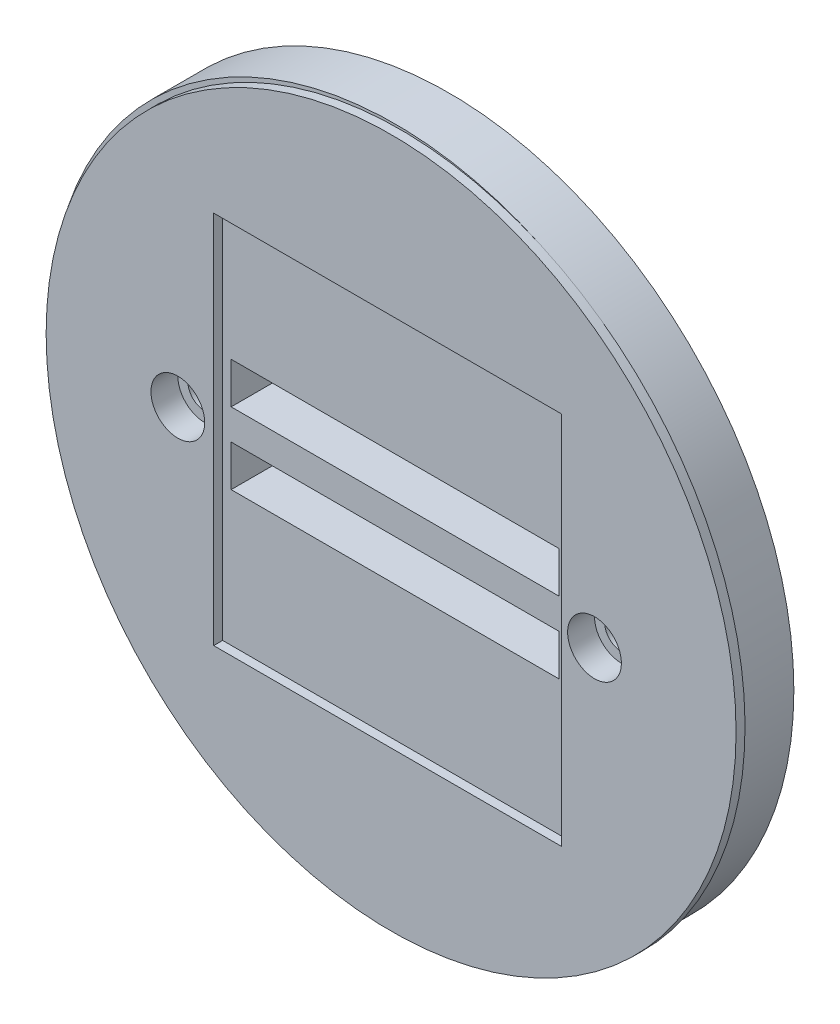
ISO-10303-21;
HEADER;
FILE_DESCRIPTION(('STEP AP214'),'2;1');
FILE_NAME('part.step','',(''),(''),'','','');
FILE_SCHEMA(('AUTOMOTIVE_DESIGN { 1 0 10303 214 1 1 1 1 }'));
ENDSEC;
DATA;
#1=APPLICATION_CONTEXT('core data for automotive mechanical design processes');
#2=APPLICATION_PROTOCOL_DEFINITION('international standard','automotive_design',2000,#1);
#3=PRODUCT_CONTEXT('',#1,'mechanical');
#4=PRODUCT('Part','Part','',(#3));
#5=PRODUCT_RELATED_PRODUCT_CATEGORY('part','',(#4));
#6=PRODUCT_DEFINITION_FORMATION('','',#4);
#7=PRODUCT_DEFINITION_CONTEXT('part definition',#1,'design');
#8=PRODUCT_DEFINITION('design','',#6,#7);
#9=PRODUCT_DEFINITION_SHAPE('','',#8);
#10=(LENGTH_UNIT() NAMED_UNIT(*) SI_UNIT(.MILLI.,.METRE.));
#11=(NAMED_UNIT(*) PLANE_ANGLE_UNIT() SI_UNIT($,.RADIAN.));
#12=(NAMED_UNIT(*) SI_UNIT($,.STERADIAN.) SOLID_ANGLE_UNIT());
#13=UNCERTAINTY_MEASURE_WITH_UNIT(LENGTH_MEASURE(1.E-05),#10,'distance_accuracy_value','');
#14=(GEOMETRIC_REPRESENTATION_CONTEXT(3) GLOBAL_UNCERTAINTY_ASSIGNED_CONTEXT((#13)) GLOBAL_UNIT_ASSIGNED_CONTEXT((#10,
#11,#12)) REPRESENTATION_CONTEXT('',''));
#15=CARTESIAN_POINT('',(0.,0.,0.));
#16=DIRECTION('',(0.,0.,1.));
#17=DIRECTION('',(1.,0.,0.));
#18=AXIS2_PLACEMENT_3D('',#15,#16,#17);
#19=CARTESIAN_POINT('',(23.25,0.,-6.));
#20=DIRECTION('',(0.,0.,1.));
#21=DIRECTION('',(1.,0.,0.));
#22=AXIS2_PLACEMENT_3D('',#19,#20,#21);
#23=CYLINDRICAL_SURFACE('',#22,1.875);
#24=CARTESIAN_POINT('',(23.25,0.,-6.));
#25=DIRECTION('',(0.,0.,1.));
#26=DIRECTION('',(-1.,0.,0.));
#27=AXIS2_PLACEMENT_3D('',#24,#25,#26);
#28=CIRCLE('',#27,1.875);
#29=CARTESIAN_POINT('',(21.375,0.,-6.));
#30=VERTEX_POINT('',#29);
#31=EDGE_CURVE('E176',#30,#30,#28,.T.);
#32=ORIENTED_EDGE('',*,*,#31,.F.);
#33=EDGE_LOOP('',(#32));
#34=FACE_BOUND('',#33,.T.);
#35=CARTESIAN_POINT('',(23.25,0.,-2.));
#36=DIRECTION('',(0.,0.,1.));
#37=DIRECTION('',(1.,0.,0.));
#38=AXIS2_PLACEMENT_3D('',#35,#36,#37);
#39=CIRCLE('',#38,1.875);
#40=CARTESIAN_POINT('',(25.125,0.,-2.));
#41=VERTEX_POINT('',#40);
#42=EDGE_CURVE('E37',#41,#41,#39,.F.);
#43=ORIENTED_EDGE('',*,*,#42,.F.);
#44=EDGE_LOOP('',(#43));
#45=FACE_BOUND('',#44,.T.);
#46=ADVANCED_FACE('F33',(#34,#45),#23,.F.);
#47=CARTESIAN_POINT('',(-23.25,0.,-6.));
#48=DIRECTION('',(0.,0.,1.));
#49=DIRECTION('',(1.,0.,0.));
#50=AXIS2_PLACEMENT_3D('',#47,#48,#49);
#51=CYLINDRICAL_SURFACE('',#50,1.875);
#52=CARTESIAN_POINT('',(-23.25,0.,-6.));
#53=DIRECTION('',(0.,0.,1.));
#54=DIRECTION('',(1.,0.,0.));
#55=AXIS2_PLACEMENT_3D('',#52,#53,#54);
#56=CIRCLE('',#55,1.875);
#57=CARTESIAN_POINT('',(-21.375,0.,-6.));
#58=VERTEX_POINT('',#57);
#59=EDGE_CURVE('E206',#58,#58,#56,.T.);
#60=ORIENTED_EDGE('',*,*,#59,.F.);
#61=EDGE_LOOP('',(#60));
#62=FACE_BOUND('',#61,.T.);
#63=CARTESIAN_POINT('',(-23.25,0.,-2.));
#64=DIRECTION('',(0.,0.,1.));
#65=DIRECTION('',(1.,0.,0.));
#66=AXIS2_PLACEMENT_3D('',#63,#64,#65);
#67=CIRCLE('',#66,1.875);
#68=CARTESIAN_POINT('',(-21.375,0.,-2.));
#69=VERTEX_POINT('',#68);
#70=EDGE_CURVE('E162',#69,#69,#67,.F.);
#71=ORIENTED_EDGE('',*,*,#70,.F.);
#72=EDGE_LOOP('',(#71));
#73=FACE_BOUND('',#72,.T.);
#74=ADVANCED_FACE('F272',(#62,#73),#51,.F.);
#75=CARTESIAN_POINT('',(0.,0.,0.));
#76=DIRECTION('',(0.,0.,1.));
#77=DIRECTION('',(1.,0.,0.));
#78=AXIS2_PLACEMENT_3D('',#75,#76,#77);
#79=PLANE('',#78);
#80=DIRECTION('',(-1.,0.,0.));
#81=VECTOR('',#80,1.);
#82=CARTESIAN_POINT('',(-18.3,6.59999999999948,0.));
#83=LINE('',#82,#81);
#84=CARTESIAN_POINT('',(18.3,6.59999999999948,0.));
#85=VERTEX_POINT('',#84);
#86=CARTESIAN_POINT('',(-18.3,6.59999999999948,0.));
#87=VERTEX_POINT('',#86);
#88=EDGE_CURVE('E215',#85,#87,#83,.T.);
#89=ORIENTED_EDGE('',*,*,#88,.F.);
#90=DIRECTION('',(0.,1.,0.));
#91=VECTOR('',#90,1.);
#92=CARTESIAN_POINT('',(18.3,6.59999999999948,0.));
#93=LINE('',#92,#91);
#94=CARTESIAN_POINT('',(18.3,1.99999999999948,0.));
#95=VERTEX_POINT('',#94);
#96=EDGE_CURVE('E220',#95,#85,#93,.T.);
#97=ORIENTED_EDGE('',*,*,#96,.F.);
#98=DIRECTION('',(1.,0.,0.));
#99=VECTOR('',#98,1.);
#100=CARTESIAN_POINT('',(18.3,1.99999999999948,0.));
#101=LINE('',#100,#99);
#102=CARTESIAN_POINT('',(-18.3,1.99999999999948,0.));
#103=VERTEX_POINT('',#102);
#104=EDGE_CURVE('E234',#103,#95,#101,.T.);
#105=ORIENTED_EDGE('',*,*,#104,.F.);
#106=DIRECTION('',(0.,-1.,0.));
#107=VECTOR('',#106,1.);
#108=CARTESIAN_POINT('',(-18.3,1.99999999999948,0.));
#109=LINE('',#108,#107);
#110=EDGE_CURVE('E231',#87,#103,#109,.T.);
#111=ORIENTED_EDGE('',*,*,#110,.F.);
#112=EDGE_LOOP('',(#89,#97,#105,#111));
#113=FACE_BOUND('',#112,.T.);
#114=DIRECTION('',(0.,1.,0.));
#115=VECTOR('',#114,1.);
#116=CARTESIAN_POINT('',(18.3,-6.00000000000038,0.));
#117=LINE('',#116,#115);
#118=CARTESIAN_POINT('',(18.3,-6.00000000000038,0.));
#119=VERTEX_POINT('',#118);
#120=CARTESIAN_POINT('',(18.3,-1.40000000000038,0.));
#121=VERTEX_POINT('',#120);
#122=EDGE_CURVE('E180',#119,#121,#117,.T.);
#123=ORIENTED_EDGE('',*,*,#122,.F.);
#124=DIRECTION('',(1.,0.,0.));
#125=VECTOR('',#124,1.);
#126=CARTESIAN_POINT('',(-18.3,-6.00000000000038,0.));
#127=LINE('',#126,#125);
#128=CARTESIAN_POINT('',(-18.3,-6.00000000000038,0.));
#129=VERTEX_POINT('',#128);
#130=EDGE_CURVE('E185',#129,#119,#127,.T.);
#131=ORIENTED_EDGE('',*,*,#130,.F.);
#132=DIRECTION('',(0.,-1.,0.));
#133=VECTOR('',#132,1.);
#134=CARTESIAN_POINT('',(-18.3,-1.40000000000038,0.));
#135=LINE('',#134,#133);
#136=CARTESIAN_POINT('',(-18.3,-1.40000000000038,0.));
#137=VERTEX_POINT('',#136);
#138=EDGE_CURVE('E199',#137,#129,#135,.T.);
#139=ORIENTED_EDGE('',*,*,#138,.F.);
#140=DIRECTION('',(-1.,0.,0.));
#141=VECTOR('',#140,1.);
#142=CARTESIAN_POINT('',(18.3,-1.40000000000038,0.));
#143=LINE('',#142,#141);
#144=EDGE_CURVE('E196',#121,#137,#143,.T.);
#145=ORIENTED_EDGE('',*,*,#144,.F.);
#146=EDGE_LOOP('',(#123,#131,#139,#145));
#147=FACE_BOUND('',#146,.T.);
#148=DIRECTION('',(1.,0.,0.));
#149=VECTOR('',#148,1.);
#150=CARTESIAN_POINT('',(-19.25,-21.05,0.));
#151=LINE('',#150,#149);
#152=CARTESIAN_POINT('',(-19.25,-21.05,0.));
#153=VERTEX_POINT('',#152);
#154=CARTESIAN_POINT('',(19.55,-21.05,0.));
#155=VERTEX_POINT('',#154);
#156=EDGE_CURVE('E140',#153,#155,#151,.T.);
#157=ORIENTED_EDGE('',*,*,#156,.T.);
#158=DIRECTION('',(0.,1.,0.));
#159=VECTOR('',#158,1.);
#160=CARTESIAN_POINT('',(19.55,20.75,0.));
#161=LINE('',#160,#159);
#162=CARTESIAN_POINT('',(19.55,20.75,0.));
#163=VERTEX_POINT('',#162);
#164=EDGE_CURVE('E160',#155,#163,#161,.T.);
#165=ORIENTED_EDGE('',*,*,#164,.T.);
#166=DIRECTION('',(-1.,0.,0.));
#167=VECTOR('',#166,1.);
#168=CARTESIAN_POINT('',(-19.25,20.75,0.));
#169=LINE('',#168,#167);
#170=CARTESIAN_POINT('',(-19.25,20.75,0.));
#171=VERTEX_POINT('',#170);
#172=EDGE_CURVE('E146',#163,#171,#169,.T.);
#173=ORIENTED_EDGE('',*,*,#172,.T.);
#174=DIRECTION('',(0.,-1.,0.));
#175=VECTOR('',#174,1.);
#176=CARTESIAN_POINT('',(-19.25,20.75,0.));
#177=LINE('',#176,#175);
#178=EDGE_CURVE('E164',#171,#153,#177,.T.);
#179=ORIENTED_EDGE('',*,*,#178,.T.);
#180=EDGE_LOOP('',(#157,#165,#173,#179));
#181=FACE_BOUND('',#180,.T.);
#182=ADVANCED_FACE('F278',(#113,#147,#181),#79,.T.);
#183=CARTESIAN_POINT('',(0.,0.,-6.));
#184=DIRECTION('',(0.,0.,1.));
#185=DIRECTION('',(1.,0.,0.));
#186=AXIS2_PLACEMENT_3D('',#183,#184,#185);
#187=CYLINDRICAL_SURFACE('',#186,38.5);
#188=CARTESIAN_POINT('',(0.,0.,-6.));
#189=DIRECTION('',(0.,0.,1.));
#190=DIRECTION('',(1.,0.,0.));
#191=AXIS2_PLACEMENT_3D('',#188,#189,#190);
#192=CIRCLE('',#191,38.5);
#193=CARTESIAN_POINT('',(38.5,0.,-6.));
#194=VERTEX_POINT('',#193);
#195=EDGE_CURVE('E11',#194,#194,#192,.T.);
#196=ORIENTED_EDGE('',*,*,#195,.T.);
#197=EDGE_LOOP('',(#196));
#198=FACE_BOUND('',#197,.T.);
#199=CARTESIAN_POINT('',(0.,0.,0.));
#200=DIRECTION('',(0.,0.,1.));
#201=DIRECTION('',(1.,0.,0.));
#202=AXIS2_PLACEMENT_3D('',#199,#200,#201);
#203=CIRCLE('',#202,38.5);
#204=CARTESIAN_POINT('',(16.2059229646879,34.9230305223158,0.));
#205=VERTEX_POINT('',#204);
#206=CARTESIAN_POINT('',(-15.6559229646895,-35.173030522315,0.));
#207=VERTEX_POINT('',#206);
#208=EDGE_CURVE('E42',#205,#207,#203,.T.);
#209=ORIENTED_EDGE('',*,*,#208,.F.);
#210=EDGE_CURVE('E241',#207,#205,#203,.T.);
#211=ORIENTED_EDGE('',*,*,#210,.F.);
#212=EDGE_LOOP('',(#209,#211));
#213=FACE_BOUND('',#212,.T.);
#214=ADVANCED_FACE('F35',(#198,#213),#187,.T.);
#215=CARTESIAN_POINT('',(0.,0.,-6.));
#216=DIRECTION('',(0.,0.,1.));
#217=DIRECTION('',(1.,0.,0.));
#218=AXIS2_PLACEMENT_3D('',#215,#216,#217);
#219=PLANE('',#218);
#220=ORIENTED_EDGE('',*,*,#31,.T.);
#221=EDGE_LOOP('',(#220));
#222=FACE_BOUND('',#221,.T.);
#223=DIRECTION('',(1.,0.,0.));
#224=VECTOR('',#223,1.);
#225=CARTESIAN_POINT('',(-18.3,-6.00000000000038,-6.));
#226=LINE('',#225,#224);
#227=CARTESIAN_POINT('',(-18.3,-6.00000000000038,-6.));
#228=VERTEX_POINT('',#227);
#229=CARTESIAN_POINT('',(18.3,-6.00000000000038,-6.));
#230=VERTEX_POINT('',#229);
#231=EDGE_CURVE('E191',#228,#230,#226,.T.);
#232=ORIENTED_EDGE('',*,*,#231,.T.);
#233=DIRECTION('',(0.,1.,0.));
#234=VECTOR('',#233,1.);
#235=CARTESIAN_POINT('',(18.3,-6.00000000000038,-6.));
#236=LINE('',#235,#234);
#237=CARTESIAN_POINT('',(18.3,-1.40000000000038,-6.));
#238=VERTEX_POINT('',#237);
#239=EDGE_CURVE('E181',#230,#238,#236,.T.);
#240=ORIENTED_EDGE('',*,*,#239,.T.);
#241=DIRECTION('',(-1.,0.,0.));
#242=VECTOR('',#241,1.);
#243=CARTESIAN_POINT('',(18.3,-1.40000000000038,-6.));
#244=LINE('',#243,#242);
#245=CARTESIAN_POINT('',(-18.3,-1.40000000000038,-6.));
#246=VERTEX_POINT('',#245);
#247=EDGE_CURVE('E184',#238,#246,#244,.T.);
#248=ORIENTED_EDGE('',*,*,#247,.T.);
#249=DIRECTION('',(0.,-1.,0.));
#250=VECTOR('',#249,1.);
#251=CARTESIAN_POINT('',(-18.3,-1.40000000000038,-6.));
#252=LINE('',#251,#250);
#253=EDGE_CURVE('E188',#246,#228,#252,.T.);
#254=ORIENTED_EDGE('',*,*,#253,.T.);
#255=EDGE_LOOP('',(#232,#240,#248,#254));
#256=FACE_BOUND('',#255,.T.);
#257=ORIENTED_EDGE('',*,*,#59,.T.);
#258=EDGE_LOOP('',(#257));
#259=FACE_BOUND('',#258,.T.);
#260=DIRECTION('',(0.,1.,0.));
#261=VECTOR('',#260,1.);
#262=CARTESIAN_POINT('',(18.3,6.59999999999948,-6.));
#263=LINE('',#262,#261);
#264=CARTESIAN_POINT('',(18.3,1.99999999999948,-6.));
#265=VERTEX_POINT('',#264);
#266=CARTESIAN_POINT('',(18.3,6.59999999999948,-6.));
#267=VERTEX_POINT('',#266);
#268=EDGE_CURVE('E226',#265,#267,#263,.T.);
#269=ORIENTED_EDGE('',*,*,#268,.T.);
#270=DIRECTION('',(-1.,0.,0.));
#271=VECTOR('',#270,1.);
#272=CARTESIAN_POINT('',(-18.3,6.59999999999948,-6.));
#273=LINE('',#272,#271);
#274=CARTESIAN_POINT('',(-18.3,6.59999999999948,-6.));
#275=VERTEX_POINT('',#274);
#276=EDGE_CURVE('E216',#267,#275,#273,.T.);
#277=ORIENTED_EDGE('',*,*,#276,.T.);
#278=DIRECTION('',(0.,-1.,0.));
#279=VECTOR('',#278,1.);
#280=CARTESIAN_POINT('',(-18.3,1.99999999999948,-6.));
#281=LINE('',#280,#279);
#282=CARTESIAN_POINT('',(-18.3,1.99999999999948,-6.));
#283=VERTEX_POINT('',#282);
#284=EDGE_CURVE('E219',#275,#283,#281,.T.);
#285=ORIENTED_EDGE('',*,*,#284,.T.);
#286=DIRECTION('',(1.,0.,0.));
#287=VECTOR('',#286,1.);
#288=CARTESIAN_POINT('',(18.3,1.99999999999948,-6.));
#289=LINE('',#288,#287);
#290=EDGE_CURVE('E223',#283,#265,#289,.T.);
#291=ORIENTED_EDGE('',*,*,#290,.T.);
#292=EDGE_LOOP('',(#269,#277,#285,#291));
#293=FACE_BOUND('',#292,.T.);
#294=ORIENTED_EDGE('',*,*,#195,.F.);
#295=EDGE_LOOP('',(#294));
#296=FACE_BOUND('',#295,.T.);
#297=ADVANCED_FACE('F320',(#222,#256,#259,#293,#296),#219,.F.);
#298=CARTESIAN_POINT('',(0.549999999999996,-0.249999999999997,0.));
#299=DIRECTION('',(0.,0.,1.));
#300=DIRECTION('',(1.,0.,0.));
#301=AXIS2_PLACEMENT_3D('',#298,#299,#300);
#302=CIRCLE('',#301,38.5);
#303=EDGE_CURVE('E57',#205,#207,#302,.T.);
#304=ORIENTED_EDGE('',*,*,#303,.F.);
#305=ORIENTED_EDGE('',*,*,#208,.T.);
#306=EDGE_LOOP('',(#304,#305));
#307=FACE_BOUND('',#306,.T.);
#308=ADVANCED_FACE('F318',(#307),#79,.T.);
#309=CARTESIAN_POINT('',(-18.3,6.59999999999948,-6.));
#310=DIRECTION('',(0.,1.,0.));
#311=DIRECTION('',(0.,0.,1.));
#312=AXIS2_PLACEMENT_3D('',#309,#310,#311);
#313=PLANE('',#312);
#314=ORIENTED_EDGE('',*,*,#88,.T.);
#315=DIRECTION('',(0.,0.,1.));
#316=VECTOR('',#315,1.);
#317=CARTESIAN_POINT('',(-18.3,6.59999999999948,-6.));
#318=LINE('',#317,#316);
#319=EDGE_CURVE('E229',#275,#87,#318,.T.);
#320=ORIENTED_EDGE('',*,*,#319,.F.);
#321=ORIENTED_EDGE('',*,*,#276,.F.);
#322=DIRECTION('',(0.,0.,1.));
#323=VECTOR('',#322,1.);
#324=CARTESIAN_POINT('',(18.3,6.59999999999948,-6.));
#325=LINE('',#324,#323);
#326=EDGE_CURVE('E239',#267,#85,#325,.T.);
#327=ORIENTED_EDGE('',*,*,#326,.T.);
#328=EDGE_LOOP('',(#314,#320,#321,#327));
#329=FACE_BOUND('',#328,.T.);
#330=ADVANCED_FACE('F308',(#329),#313,.F.);
#331=CARTESIAN_POINT('',(18.3,6.59999999999948,-6.));
#332=DIRECTION('',(1.,0.,0.));
#333=DIRECTION('',(0.,0.,-1.));
#334=AXIS2_PLACEMENT_3D('',#331,#332,#333);
#335=PLANE('',#334);
#336=ORIENTED_EDGE('',*,*,#96,.T.);
#337=ORIENTED_EDGE('',*,*,#326,.F.);
#338=ORIENTED_EDGE('',*,*,#268,.F.);
#339=DIRECTION('',(0.,0.,1.));
#340=VECTOR('',#339,1.);
#341=CARTESIAN_POINT('',(18.3,1.99999999999948,-6.));
#342=LINE('',#341,#340);
#343=EDGE_CURVE('E242',#265,#95,#342,.T.);
#344=ORIENTED_EDGE('',*,*,#343,.T.);
#345=EDGE_LOOP('',(#336,#337,#338,#344));
#346=FACE_BOUND('',#345,.T.);
#347=ADVANCED_FACE('F304',(#346),#335,.F.);
#348=CARTESIAN_POINT('',(18.3,1.99999999999948,-6.));
#349=DIRECTION('',(0.,-1.,0.));
#350=DIRECTION('',(1.,0.,0.));
#351=AXIS2_PLACEMENT_3D('',#348,#349,#350);
#352=PLANE('',#351);
#353=ORIENTED_EDGE('',*,*,#104,.T.);
#354=ORIENTED_EDGE('',*,*,#343,.F.);
#355=ORIENTED_EDGE('',*,*,#290,.F.);
#356=DIRECTION('',(0.,0.,1.));
#357=VECTOR('',#356,1.);
#358=CARTESIAN_POINT('',(-18.3,1.99999999999948,-6.));
#359=LINE('',#358,#357);
#360=EDGE_CURVE('E244',#283,#103,#359,.T.);
#361=ORIENTED_EDGE('',*,*,#360,.T.);
#362=EDGE_LOOP('',(#353,#354,#355,#361));
#363=FACE_BOUND('',#362,.T.);
#364=ADVANCED_FACE('F307',(#363),#352,.F.);
#365=CARTESIAN_POINT('',(-18.3,1.99999999999948,-6.));
#366=DIRECTION('',(-1.,0.,0.));
#367=DIRECTION('',(0.,0.,1.));
#368=AXIS2_PLACEMENT_3D('',#365,#366,#367);
#369=PLANE('',#368);
#370=ORIENTED_EDGE('',*,*,#110,.T.);
#371=ORIENTED_EDGE('',*,*,#360,.F.);
#372=ORIENTED_EDGE('',*,*,#284,.F.);
#373=ORIENTED_EDGE('',*,*,#319,.T.);
#374=EDGE_LOOP('',(#370,#371,#372,#373));
#375=FACE_BOUND('',#374,.T.);
#376=ADVANCED_FACE('F301',(#375),#369,.F.);
#377=CARTESIAN_POINT('',(18.3,-6.00000000000038,-6.));
#378=DIRECTION('',(1.,0.,0.));
#379=DIRECTION('',(0.,0.,-1.));
#380=AXIS2_PLACEMENT_3D('',#377,#378,#379);
#381=PLANE('',#380);
#382=ORIENTED_EDGE('',*,*,#122,.T.);
#383=DIRECTION('',(0.,0.,1.));
#384=VECTOR('',#383,1.);
#385=CARTESIAN_POINT('',(18.3,-1.40000000000038,-6.));
#386=LINE('',#385,#384);
#387=EDGE_CURVE('E194',#238,#121,#386,.T.);
#388=ORIENTED_EDGE('',*,*,#387,.F.);
#389=ORIENTED_EDGE('',*,*,#239,.F.);
#390=DIRECTION('',(0.,0.,1.));
#391=VECTOR('',#390,1.);
#392=CARTESIAN_POINT('',(18.3,-6.00000000000038,-6.));
#393=LINE('',#392,#391);
#394=EDGE_CURVE('E204',#230,#119,#393,.T.);
#395=ORIENTED_EDGE('',*,*,#394,.T.);
#396=EDGE_LOOP('',(#382,#388,#389,#395));
#397=FACE_BOUND('',#396,.T.);
#398=ADVANCED_FACE('F290',(#397),#381,.F.);
#399=CARTESIAN_POINT('',(-18.3,-6.00000000000038,-6.));
#400=DIRECTION('',(0.,-1.,0.));
#401=DIRECTION('',(0.,0.,-1.));
#402=AXIS2_PLACEMENT_3D('',#399,#400,#401);
#403=PLANE('',#402);
#404=ORIENTED_EDGE('',*,*,#130,.T.);
#405=ORIENTED_EDGE('',*,*,#394,.F.);
#406=ORIENTED_EDGE('',*,*,#231,.F.);
#407=DIRECTION('',(0.,0.,1.));
#408=VECTOR('',#407,1.);
#409=CARTESIAN_POINT('',(-18.3,-6.00000000000038,-6.));
#410=LINE('',#409,#408);
#411=EDGE_CURVE('E207',#228,#129,#410,.T.);
#412=ORIENTED_EDGE('',*,*,#411,.T.);
#413=EDGE_LOOP('',(#404,#405,#406,#412));
#414=FACE_BOUND('',#413,.T.);
#415=ADVANCED_FACE('F286',(#414),#403,.F.);
#416=CARTESIAN_POINT('',(-18.3,-1.40000000000038,-6.));
#417=DIRECTION('',(-1.,0.,0.));
#418=DIRECTION('',(0.,0.,1.));
#419=AXIS2_PLACEMENT_3D('',#416,#417,#418);
#420=PLANE('',#419);
#421=ORIENTED_EDGE('',*,*,#138,.T.);
#422=ORIENTED_EDGE('',*,*,#411,.F.);
#423=ORIENTED_EDGE('',*,*,#253,.F.);
#424=DIRECTION('',(0.,0.,1.));
#425=VECTOR('',#424,1.);
#426=CARTESIAN_POINT('',(-18.3,-1.40000000000038,-6.));
#427=LINE('',#426,#425);
#428=EDGE_CURVE('E209',#246,#137,#427,.T.);
#429=ORIENTED_EDGE('',*,*,#428,.T.);
#430=EDGE_LOOP('',(#421,#422,#423,#429));
#431=FACE_BOUND('',#430,.T.);
#432=ADVANCED_FACE('F289',(#431),#420,.F.);
#433=CARTESIAN_POINT('',(18.3,-1.40000000000038,-6.));
#434=DIRECTION('',(0.,1.,0.));
#435=DIRECTION('',(-1.,0.,0.));
#436=AXIS2_PLACEMENT_3D('',#433,#434,#435);
#437=PLANE('',#436);
#438=ORIENTED_EDGE('',*,*,#144,.T.);
#439=ORIENTED_EDGE('',*,*,#428,.F.);
#440=ORIENTED_EDGE('',*,*,#247,.F.);
#441=ORIENTED_EDGE('',*,*,#387,.T.);
#442=EDGE_LOOP('',(#438,#439,#440,#441));
#443=FACE_BOUND('',#442,.T.);
#444=ADVANCED_FACE('F294',(#443),#437,.F.);
#445=CARTESIAN_POINT('',(0.549999999999996,-0.249999999999997,0.));
#446=DIRECTION('',(0.,0.,1.));
#447=DIRECTION('',(1.,0.,0.));
#448=AXIS2_PLACEMENT_3D('',#445,#446,#447);
#449=PLANE('',#448);
#450=EDGE_CURVE('E147',#207,#205,#302,.T.);
#451=ORIENTED_EDGE('',*,*,#450,.F.);
#452=ORIENTED_EDGE('',*,*,#210,.T.);
#453=EDGE_LOOP('',(#451,#452));
#454=FACE_BOUND('',#453,.T.);
#455=ADVANCED_FACE('F298',(#454),#449,.F.);
#456=CARTESIAN_POINT('',(0.549999999999996,-0.249999999999997,1.));
#457=DIRECTION('',(0.,0.,1.));
#458=DIRECTION('',(1.,0.,0.));
#459=AXIS2_PLACEMENT_3D('',#456,#457,#458);
#460=PLANE('',#459);
#461=CARTESIAN_POINT('',(23.25,0.,1.));
#462=DIRECTION('',(0.,0.,1.));
#463=DIRECTION('',(1.,0.,0.));
#464=AXIS2_PLACEMENT_3D('',#461,#462,#463);
#465=CIRCLE('',#464,3.);
#466=CARTESIAN_POINT('',(26.25,0.,1.));
#467=VERTEX_POINT('',#466);
#468=EDGE_CURVE('E259',#467,#467,#465,.T.);
#469=ORIENTED_EDGE('',*,*,#468,.F.);
#470=EDGE_LOOP('',(#469));
#471=FACE_BOUND('',#470,.T.);
#472=CARTESIAN_POINT('',(-23.25,0.,1.));
#473=DIRECTION('',(0.,0.,1.));
#474=DIRECTION('',(1.,0.,0.));
#475=AXIS2_PLACEMENT_3D('',#472,#473,#474);
#476=CIRCLE('',#475,3.);
#477=CARTESIAN_POINT('',(-20.25,0.,1.));
#478=VERTEX_POINT('',#477);
#479=EDGE_CURVE('E253',#478,#478,#476,.T.);
#480=ORIENTED_EDGE('',*,*,#479,.F.);
#481=EDGE_LOOP('',(#480));
#482=FACE_BOUND('',#481,.T.);
#483=CARTESIAN_POINT('',(0.549999999999996,-0.249999999999997,1.));
#484=DIRECTION('',(0.,0.,1.));
#485=DIRECTION('',(1.,0.,0.));
#486=AXIS2_PLACEMENT_3D('',#483,#484,#485);
#487=CIRCLE('',#486,38.5);
#488=CARTESIAN_POINT('',(39.05,-0.249999999999997,1.));
#489=VERTEX_POINT('',#488);
#490=EDGE_CURVE('E173',#489,#489,#487,.T.);
#491=ORIENTED_EDGE('',*,*,#490,.T.);
#492=EDGE_LOOP('',(#491));
#493=FACE_BOUND('',#492,.T.);
#494=DIRECTION('',(-1.,0.,0.));
#495=VECTOR('',#494,1.);
#496=CARTESIAN_POINT('',(-19.25,20.75,1.));
#497=LINE('',#496,#495);
#498=CARTESIAN_POINT('',(19.55,20.75,1.));
#499=VERTEX_POINT('',#498);
#500=CARTESIAN_POINT('',(-19.25,20.75,1.));
#501=VERTEX_POINT('',#500);
#502=EDGE_CURVE('E139',#499,#501,#497,.T.);
#503=ORIENTED_EDGE('',*,*,#502,.F.);
#504=DIRECTION('',(0.,1.,0.));
#505=VECTOR('',#504,1.);
#506=CARTESIAN_POINT('',(19.55,20.75,1.));
#507=LINE('',#506,#505);
#508=CARTESIAN_POINT('',(19.55,-21.05,1.));
#509=VERTEX_POINT('',#508);
#510=EDGE_CURVE('E131',#509,#499,#507,.T.);
#511=ORIENTED_EDGE('',*,*,#510,.F.);
#512=DIRECTION('',(1.,0.,0.));
#513=VECTOR('',#512,1.);
#514=CARTESIAN_POINT('',(-19.25,-21.05,1.));
#515=LINE('',#514,#513);
#516=CARTESIAN_POINT('',(-19.25,-21.05,1.));
#517=VERTEX_POINT('',#516);
#518=EDGE_CURVE('E155',#517,#509,#515,.T.);
#519=ORIENTED_EDGE('',*,*,#518,.F.);
#520=DIRECTION('',(0.,-1.,0.));
#521=VECTOR('',#520,1.);
#522=CARTESIAN_POINT('',(-19.25,20.75,1.));
#523=LINE('',#522,#521);
#524=EDGE_CURVE('E153',#501,#517,#523,.T.);
#525=ORIENTED_EDGE('',*,*,#524,.F.);
#526=EDGE_LOOP('',(#503,#511,#519,#525));
#527=FACE_BOUND('',#526,.T.);
#528=ADVANCED_FACE('F151',(#471,#482,#493,#527),#460,.T.);
#529=CARTESIAN_POINT('',(0.549999999999996,-0.249999999999997,1.));
#530=DIRECTION('',(0.,0.,-1.));
#531=DIRECTION('',(-1.,0.,0.));
#532=AXIS2_PLACEMENT_3D('',#529,#530,#531);
#533=CYLINDRICAL_SURFACE('',#532,38.5);
#534=ORIENTED_EDGE('',*,*,#490,.F.);
#535=EDGE_LOOP('',(#534));
#536=FACE_BOUND('',#535,.T.);
#537=ORIENTED_EDGE('',*,*,#303,.T.);
#538=ORIENTED_EDGE('',*,*,#450,.T.);
#539=EDGE_LOOP('',(#537,#538));
#540=FACE_BOUND('',#539,.T.);
#541=ADVANCED_FACE('F284',(#536,#540),#533,.T.);
#542=CARTESIAN_POINT('',(19.55,20.75,1.));
#543=DIRECTION('',(-1.,0.,0.));
#544=DIRECTION('',(0.,-1.,0.));
#545=AXIS2_PLACEMENT_3D('',#542,#543,#544);
#546=PLANE('',#545);
#547=ORIENTED_EDGE('',*,*,#164,.F.);
#548=DIRECTION('',(0.,0.,-1.));
#549=VECTOR('',#548,1.);
#550=CARTESIAN_POINT('',(19.55,-21.05,1.));
#551=LINE('',#550,#549);
#552=EDGE_CURVE('E50',#509,#155,#551,.T.);
#553=ORIENTED_EDGE('',*,*,#552,.F.);
#554=ORIENTED_EDGE('',*,*,#510,.T.);
#555=DIRECTION('',(0.,0.,-1.));
#556=VECTOR('',#555,1.);
#557=CARTESIAN_POINT('',(19.55,20.75,1.));
#558=LINE('',#557,#556);
#559=EDGE_CURVE('E134',#499,#163,#558,.T.);
#560=ORIENTED_EDGE('',*,*,#559,.T.);
#561=EDGE_LOOP('',(#547,#553,#554,#560));
#562=FACE_BOUND('',#561,.T.);
#563=ADVANCED_FACE('F133',(#562),#546,.T.);
#564=CARTESIAN_POINT('',(-19.25,20.75,1.));
#565=DIRECTION('',(0.,-1.,0.));
#566=DIRECTION('',(0.,0.,-1.));
#567=AXIS2_PLACEMENT_3D('',#564,#565,#566);
#568=PLANE('',#567);
#569=ORIENTED_EDGE('',*,*,#172,.F.);
#570=ORIENTED_EDGE('',*,*,#559,.F.);
#571=ORIENTED_EDGE('',*,*,#502,.T.);
#572=DIRECTION('',(0.,0.,-1.));
#573=VECTOR('',#572,1.);
#574=CARTESIAN_POINT('',(-19.25,20.75,1.));
#575=LINE('',#574,#573);
#576=EDGE_CURVE('E148',#501,#171,#575,.T.);
#577=ORIENTED_EDGE('',*,*,#576,.T.);
#578=EDGE_LOOP('',(#569,#570,#571,#577));
#579=FACE_BOUND('',#578,.T.);
#580=ADVANCED_FACE('F143',(#579),#568,.T.);
#581=CARTESIAN_POINT('',(-19.25,20.75,1.));
#582=DIRECTION('',(1.,0.,0.));
#583=DIRECTION('',(0.,1.,0.));
#584=AXIS2_PLACEMENT_3D('',#581,#582,#583);
#585=PLANE('',#584);
#586=ORIENTED_EDGE('',*,*,#178,.F.);
#587=ORIENTED_EDGE('',*,*,#576,.F.);
#588=ORIENTED_EDGE('',*,*,#524,.T.);
#589=DIRECTION('',(0.,0.,-1.));
#590=VECTOR('',#589,1.);
#591=CARTESIAN_POINT('',(-19.25,-21.05,1.));
#592=LINE('',#591,#590);
#593=EDGE_CURVE('E170',#517,#153,#592,.T.);
#594=ORIENTED_EDGE('',*,*,#593,.T.);
#595=EDGE_LOOP('',(#586,#587,#588,#594));
#596=FACE_BOUND('',#595,.T.);
#597=ADVANCED_FACE('F343',(#596),#585,.T.);
#598=CARTESIAN_POINT('',(-19.25,-21.05,1.));
#599=DIRECTION('',(0.,1.,0.));
#600=DIRECTION('',(0.,0.,1.));
#601=AXIS2_PLACEMENT_3D('',#598,#599,#600);
#602=PLANE('',#601);
#603=ORIENTED_EDGE('',*,*,#156,.F.);
#604=ORIENTED_EDGE('',*,*,#593,.F.);
#605=ORIENTED_EDGE('',*,*,#518,.T.);
#606=ORIENTED_EDGE('',*,*,#552,.T.);
#607=EDGE_LOOP('',(#603,#604,#605,#606));
#608=FACE_BOUND('',#607,.T.);
#609=ADVANCED_FACE('F341',(#608),#602,.T.);
#610=CARTESIAN_POINT('',(-23.25,0.,-2.));
#611=DIRECTION('',(0.,0.,1.));
#612=DIRECTION('',(1.,0.,0.));
#613=AXIS2_PLACEMENT_3D('',#610,#611,#612);
#614=PLANE('',#613);
#615=CARTESIAN_POINT('',(-23.25,0.,-2.));
#616=DIRECTION('',(0.,0.,1.));
#617=DIRECTION('',(1.,0.,0.));
#618=AXIS2_PLACEMENT_3D('',#615,#616,#617);
#619=CIRCLE('',#618,3.);
#620=CARTESIAN_POINT('',(-20.25,0.,-2.));
#621=VERTEX_POINT('',#620);
#622=EDGE_CURVE('E249',#621,#621,#619,.T.);
#623=ORIENTED_EDGE('',*,*,#622,.T.);
#624=EDGE_LOOP('',(#623));
#625=FACE_BOUND('',#624,.T.);
#626=ORIENTED_EDGE('',*,*,#70,.T.);
#627=EDGE_LOOP('',(#626));
#628=FACE_BOUND('',#627,.T.);
#629=ADVANCED_FACE('F350',(#625,#628),#614,.T.);
#630=CARTESIAN_POINT('',(-23.25,0.,-2.));
#631=DIRECTION('',(0.,0.,1.));
#632=DIRECTION('',(1.,0.,0.));
#633=AXIS2_PLACEMENT_3D('',#630,#631,#632);
#634=CYLINDRICAL_SURFACE('',#633,3.);
#635=ORIENTED_EDGE('',*,*,#622,.F.);
#636=EDGE_LOOP('',(#635));
#637=FACE_BOUND('',#636,.T.);
#638=ORIENTED_EDGE('',*,*,#479,.T.);
#639=EDGE_LOOP('',(#638));
#640=FACE_BOUND('',#639,.T.);
#641=ADVANCED_FACE('F418',(#637,#640),#634,.F.);
#642=CARTESIAN_POINT('',(23.25,0.,-2.));
#643=DIRECTION('',(0.,0.,1.));
#644=DIRECTION('',(1.,0.,0.));
#645=AXIS2_PLACEMENT_3D('',#642,#643,#644);
#646=PLANE('',#645);
#647=CARTESIAN_POINT('',(23.25,0.,-2.));
#648=DIRECTION('',(0.,0.,1.));
#649=DIRECTION('',(1.,0.,0.));
#650=AXIS2_PLACEMENT_3D('',#647,#648,#649);
#651=CIRCLE('',#650,3.);
#652=CARTESIAN_POINT('',(26.25,0.,-2.));
#653=VERTEX_POINT('',#652);
#654=EDGE_CURVE('E262',#653,#653,#651,.T.);
#655=ORIENTED_EDGE('',*,*,#654,.T.);
#656=EDGE_LOOP('',(#655));
#657=FACE_BOUND('',#656,.T.);
#658=ORIENTED_EDGE('',*,*,#42,.T.);
#659=EDGE_LOOP('',(#658));
#660=FACE_BOUND('',#659,.T.);
#661=ADVANCED_FACE('F269',(#657,#660),#646,.T.);
#662=CARTESIAN_POINT('',(23.25,0.,-2.));
#663=DIRECTION('',(0.,0.,1.));
#664=DIRECTION('',(1.,0.,0.));
#665=AXIS2_PLACEMENT_3D('',#662,#663,#664);
#666=CYLINDRICAL_SURFACE('',#665,3.);
#667=ORIENTED_EDGE('',*,*,#654,.F.);
#668=EDGE_LOOP('',(#667));
#669=FACE_BOUND('',#668,.T.);
#670=ORIENTED_EDGE('',*,*,#468,.T.);
#671=EDGE_LOOP('',(#670));
#672=FACE_BOUND('',#671,.T.);
#673=ADVANCED_FACE('F435',(#669,#672),#666,.F.);
#674=CLOSED_SHELL('',(#46,#74,#182,#214,#297,#308,#330,#347,#364,#376,#398,#415,#432,#444,#455,
#528,#541,#563,#580,#597,#609,#629,#641,#661,#673));
#675=MANIFOLD_SOLID_BREP('B2',#674);
#676=ADVANCED_BREP_SHAPE_REPRESENTATION('',(#18,#675),#14);
#677=SHAPE_DEFINITION_REPRESENTATION(#9,#676);
ENDSEC;
END-ISO-10303-21;
